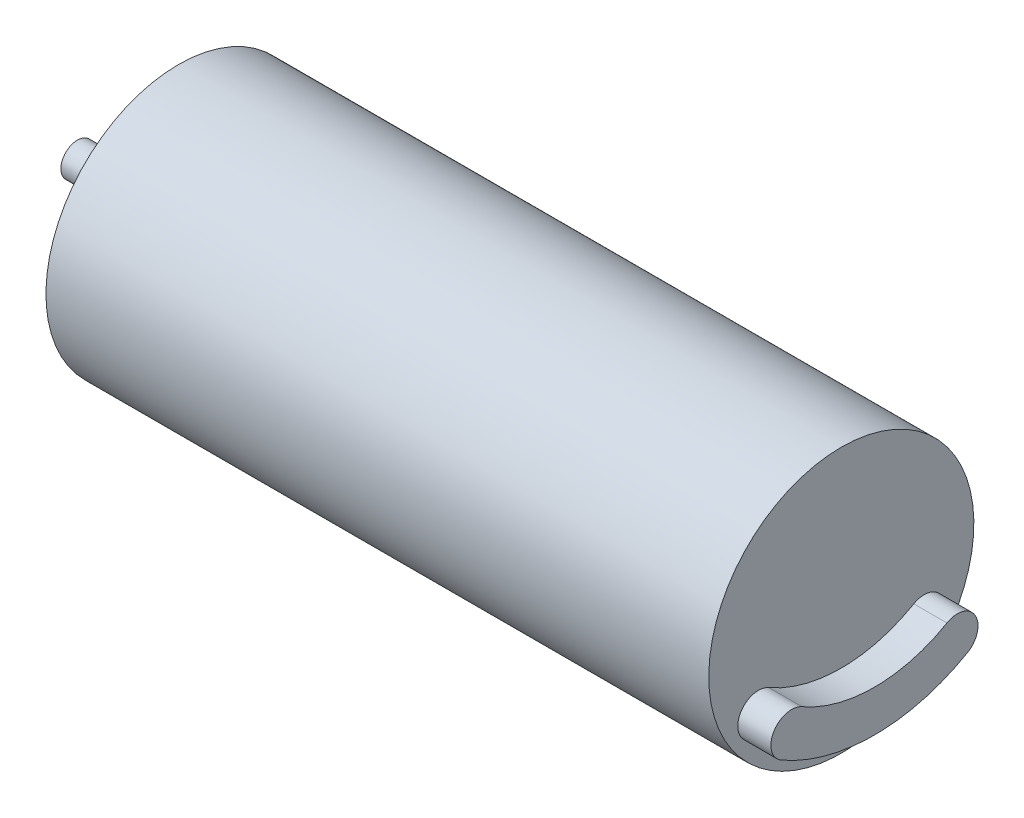
ISO-10303-21;
HEADER;
FILE_DESCRIPTION(('STEP AP214'),'2;1');
FILE_NAME('part.step','',(''),(''),'','','');
FILE_SCHEMA(('AUTOMOTIVE_DESIGN { 1 0 10303 214 1 1 1 1 }'));
ENDSEC;
DATA;
#1=APPLICATION_CONTEXT('core data for automotive mechanical design processes');
#2=APPLICATION_PROTOCOL_DEFINITION('international standard','automotive_design',2000,#1);
#3=PRODUCT_CONTEXT('',#1,'mechanical');
#4=PRODUCT('Part','Part','',(#3));
#5=PRODUCT_RELATED_PRODUCT_CATEGORY('part','',(#4));
#6=PRODUCT_DEFINITION_FORMATION('','',#4);
#7=PRODUCT_DEFINITION_CONTEXT('part definition',#1,'design');
#8=PRODUCT_DEFINITION('design','',#6,#7);
#9=PRODUCT_DEFINITION_SHAPE('','',#8);
#10=(LENGTH_UNIT() NAMED_UNIT(*) SI_UNIT(.MILLI.,.METRE.));
#11=(NAMED_UNIT(*) PLANE_ANGLE_UNIT() SI_UNIT($,.RADIAN.));
#12=(NAMED_UNIT(*) SI_UNIT($,.STERADIAN.) SOLID_ANGLE_UNIT());
#13=UNCERTAINTY_MEASURE_WITH_UNIT(LENGTH_MEASURE(1.E-05),#10,'distance_accuracy_value','');
#14=(GEOMETRIC_REPRESENTATION_CONTEXT(3) GLOBAL_UNCERTAINTY_ASSIGNED_CONTEXT((#13)) GLOBAL_UNIT_ASSIGNED_CONTEXT((#10,
#11,#12)) REPRESENTATION_CONTEXT('',''));
#15=CARTESIAN_POINT('',(0.,0.,0.));
#16=DIRECTION('',(0.,0.,1.));
#17=DIRECTION('',(1.,0.,0.));
#18=AXIS2_PLACEMENT_3D('',#15,#16,#17);
#19=CARTESIAN_POINT('',(-17.95,0.,0.));
#20=DIRECTION('',(1.,0.,0.));
#21=DIRECTION('',(0.,0.,-1.));
#22=AXIS2_PLACEMENT_3D('',#19,#20,#21);
#23=CYLINDRICAL_SURFACE('',#22,4.5);
#24=CARTESIAN_POINT('',(-17.95,0.,0.));
#25=DIRECTION('',(-1.,0.,0.));
#26=DIRECTION('',(0.,0.,1.));
#27=AXIS2_PLACEMENT_3D('',#24,#25,#26);
#28=CIRCLE('',#27,4.5);
#29=CARTESIAN_POINT('',(-17.95,0.,4.5));
#30=VERTEX_POINT('',#29);
#31=EDGE_CURVE('E11',#30,#30,#28,.T.);
#32=ORIENTED_EDGE('',*,*,#31,.F.);
#33=EDGE_LOOP('',(#32));
#34=FACE_BOUND('',#33,.T.);
#35=CARTESIAN_POINT('',(-16.95,0.,0.));
#36=DIRECTION('',(-1.,0.,0.));
#37=DIRECTION('',(0.,0.,1.));
#38=AXIS2_PLACEMENT_3D('',#35,#36,#37);
#39=CIRCLE('',#38,4.5);
#40=CARTESIAN_POINT('',(-16.95,0.,4.5));
#41=VERTEX_POINT('',#40);
#42=EDGE_CURVE('E45',#41,#41,#39,.T.);
#43=ORIENTED_EDGE('',*,*,#42,.T.);
#44=EDGE_LOOP('',(#43));
#45=FACE_BOUND('',#44,.T.);
#46=ADVANCED_FACE('F42',(#34,#45),#23,.T.);
#47=CARTESIAN_POINT('',(-17.95,0.,0.));
#48=DIRECTION('',(-1.,0.,0.));
#49=DIRECTION('',(0.,0.,1.));
#50=AXIS2_PLACEMENT_3D('',#47,#48,#49);
#51=PLANE('',#50);
#52=ORIENTED_EDGE('',*,*,#31,.T.);
#53=EDGE_LOOP('',(#52));
#54=FACE_BOUND('',#53,.T.);
#55=ADVANCED_FACE('F57',(#54),#51,.T.);
#56=CARTESIAN_POINT('',(-16.95,0.,0.));
#57=DIRECTION('',(-1.,0.,0.));
#58=DIRECTION('',(0.,0.,1.));
#59=AXIS2_PLACEMENT_3D('',#56,#57,#58);
#60=PLANE('',#59);
#61=ORIENTED_EDGE('',*,*,#42,.F.);
#62=EDGE_LOOP('',(#61));
#63=FACE_BOUND('',#62,.T.);
#64=ADVANCED_FACE('F55',(#63),#60,.F.);
#65=CLOSED_SHELL('',(#46,#55,#64));
#66=MANIFOLD_SOLID_BREP('B2',#65);
#67=CARTESIAN_POINT('',(25.05,5.20000000000037,-2.15973072759112E-13));
#68=DIRECTION('',(-1.,0.,0.));
#69=DIRECTION('',(0.,0.,1.));
#70=AXIS2_PLACEMENT_3D('',#67,#68,#69);
#71=CYLINDRICAL_SURFACE('',#70,8.75000000000014);
#72=CARTESIAN_POINT('',(23.05,5.20000000000037,-2.15973072759112E-13));
#73=DIRECTION('',(-1.,0.,0.));
#74=DIRECTION('',(0.,0.,-1.));
#75=AXIS2_PLACEMENT_3D('',#72,#73,#74);
#76=CIRCLE('',#75,8.75000000000014);
#77=CARTESIAN_POINT('',(23.05,-2.3777222831135,-4.37500000000043));
#78=VERTEX_POINT('',#77);
#79=CARTESIAN_POINT('',(23.05,-2.3777222831135,4.375));
#80=VERTEX_POINT('',#79);
#81=EDGE_CURVE('E154',#78,#80,#76,.T.);
#82=ORIENTED_EDGE('',*,*,#81,.T.);
#83=DIRECTION('',(-1.,0.,0.));
#84=VECTOR('',#83,1.);
#85=CARTESIAN_POINT('',(25.05,-2.3777222831135,4.375));
#86=LINE('',#85,#84);
#87=CARTESIAN_POINT('',(25.05,-2.3777222831135,4.375));
#88=VERTEX_POINT('',#87);
#89=EDGE_CURVE('E40',#88,#80,#86,.T.);
#90=ORIENTED_EDGE('',*,*,#89,.F.);
#91=CARTESIAN_POINT('',(25.05,5.20000000000037,-2.15973072759112E-13));
#92=DIRECTION('',(-1.,0.,0.));
#93=DIRECTION('',(0.,0.,-1.));
#94=AXIS2_PLACEMENT_3D('',#91,#92,#93);
#95=CIRCLE('',#94,8.75000000000014);
#96=CARTESIAN_POINT('',(25.05,-2.3777222831135,-4.37500000000043));
#97=VERTEX_POINT('',#96);
#98=EDGE_CURVE('E142',#97,#88,#95,.T.);
#99=ORIENTED_EDGE('',*,*,#98,.F.);
#100=DIRECTION('',(-1.,0.,0.));
#101=VECTOR('',#100,1.);
#102=CARTESIAN_POINT('',(25.05,-2.3777222831135,-4.37500000000043));
#103=LINE('',#102,#101);
#104=EDGE_CURVE('E150',#97,#78,#103,.T.);
#105=ORIENTED_EDGE('',*,*,#104,.T.);
#106=EDGE_LOOP('',(#82,#90,#99,#105));
#107=FACE_BOUND('',#106,.T.);
#108=ADVANCED_FACE('F91',(#107),#71,.F.);
#109=CARTESIAN_POINT('',(25.05,-3.460254037844,5.));
#110=DIRECTION('',(-1.,0.,0.));
#111=DIRECTION('',(0.,0.,1.));
#112=AXIS2_PLACEMENT_3D('',#109,#110,#111);
#113=CYLINDRICAL_SURFACE('',#112,1.24999999999996);
#114=CARTESIAN_POINT('',(23.05,-3.460254037844,5.));
#115=DIRECTION('',(1.,0.,0.));
#116=DIRECTION('',(0.,0.,1.));
#117=AXIS2_PLACEMENT_3D('',#114,#115,#116);
#118=CIRCLE('',#117,1.24999999999996);
#119=CARTESIAN_POINT('',(23.05,-4.54278579257451,5.62499999999999));
#120=VERTEX_POINT('',#119);
#121=EDGE_CURVE('E146',#80,#120,#118,.T.);
#122=ORIENTED_EDGE('',*,*,#121,.T.);
#123=DIRECTION('',(-1.,0.,0.));
#124=VECTOR('',#123,1.);
#125=CARTESIAN_POINT('',(25.05,-4.54278579257451,5.62499999999999));
#126=LINE('',#125,#124);
#127=CARTESIAN_POINT('',(25.05,-4.54278579257451,5.62499999999999));
#128=VERTEX_POINT('',#127);
#129=EDGE_CURVE('E99',#128,#120,#126,.T.);
#130=ORIENTED_EDGE('',*,*,#129,.F.);
#131=CARTESIAN_POINT('',(25.05,-3.460254037844,5.));
#132=DIRECTION('',(1.,0.,0.));
#133=DIRECTION('',(0.,0.,1.));
#134=AXIS2_PLACEMENT_3D('',#131,#132,#133);
#135=CIRCLE('',#134,1.24999999999996);
#136=EDGE_CURVE('E137',#88,#128,#135,.T.);
#137=ORIENTED_EDGE('',*,*,#136,.F.);
#138=ORIENTED_EDGE('',*,*,#89,.T.);
#139=EDGE_LOOP('',(#122,#130,#137,#138));
#140=FACE_BOUND('',#139,.T.);
#141=ADVANCED_FACE('F145',(#140),#113,.T.);
#142=CARTESIAN_POINT('',(25.05,5.20000000000037,-2.15973072759112E-13));
#143=DIRECTION('',(-1.,0.,0.));
#144=DIRECTION('',(0.,0.,1.));
#145=AXIS2_PLACEMENT_3D('',#142,#143,#144);
#146=CYLINDRICAL_SURFACE('',#145,11.2500000000001);
#147=CARTESIAN_POINT('',(23.05,5.20000000000037,-2.15973072759112E-13));
#148=DIRECTION('',(1.,0.,0.));
#149=DIRECTION('',(0.,0.,1.));
#150=AXIS2_PLACEMENT_3D('',#147,#148,#149);
#151=CIRCLE('',#150,11.2500000000001);
#152=CARTESIAN_POINT('',(23.05,-4.5427857925745,-5.62500000000043));
#153=VERTEX_POINT('',#152);
#154=EDGE_CURVE('E124',#120,#153,#151,.T.);
#155=ORIENTED_EDGE('',*,*,#154,.T.);
#156=DIRECTION('',(-1.,0.,0.));
#157=VECTOR('',#156,1.);
#158=CARTESIAN_POINT('',(25.05,-4.5427857925745,-5.62500000000043));
#159=LINE('',#158,#157);
#160=CARTESIAN_POINT('',(25.05,-4.5427857925745,-5.62500000000043));
#161=VERTEX_POINT('',#160);
#162=EDGE_CURVE('E147',#161,#153,#159,.T.);
#163=ORIENTED_EDGE('',*,*,#162,.F.);
#164=CARTESIAN_POINT('',(25.05,5.20000000000037,-2.15973072759112E-13));
#165=DIRECTION('',(1.,0.,0.));
#166=DIRECTION('',(0.,0.,1.));
#167=AXIS2_PLACEMENT_3D('',#164,#165,#166);
#168=CIRCLE('',#167,11.2500000000001);
#169=EDGE_CURVE('E140',#128,#161,#168,.T.);
#170=ORIENTED_EDGE('',*,*,#169,.F.);
#171=ORIENTED_EDGE('',*,*,#129,.T.);
#172=EDGE_LOOP('',(#155,#163,#170,#171));
#173=FACE_BOUND('',#172,.T.);
#174=ADVANCED_FACE('F148',(#173),#146,.T.);
#175=CARTESIAN_POINT('',(25.05,-3.460254037844,-5.00000000000043));
#176=DIRECTION('',(-1.,0.,0.));
#177=DIRECTION('',(0.,0.,1.));
#178=AXIS2_PLACEMENT_3D('',#175,#176,#177);
#179=CYLINDRICAL_SURFACE('',#178,1.24999999999996);
#180=CARTESIAN_POINT('',(23.05,-3.460254037844,-5.00000000000043));
#181=DIRECTION('',(1.,0.,0.));
#182=DIRECTION('',(0.,0.,1.));
#183=AXIS2_PLACEMENT_3D('',#180,#181,#182);
#184=CIRCLE('',#183,1.24999999999996);
#185=EDGE_CURVE('E130',#153,#78,#184,.T.);
#186=ORIENTED_EDGE('',*,*,#185,.T.);
#187=ORIENTED_EDGE('',*,*,#104,.F.);
#188=CARTESIAN_POINT('',(25.05,-3.460254037844,-5.00000000000043));
#189=DIRECTION('',(1.,0.,0.));
#190=DIRECTION('',(0.,0.,1.));
#191=AXIS2_PLACEMENT_3D('',#188,#189,#190);
#192=CIRCLE('',#191,1.24999999999996);
#193=EDGE_CURVE('E107',#161,#97,#192,.T.);
#194=ORIENTED_EDGE('',*,*,#193,.F.);
#195=ORIENTED_EDGE('',*,*,#162,.T.);
#196=EDGE_LOOP('',(#186,#187,#194,#195));
#197=FACE_BOUND('',#196,.T.);
#198=ADVANCED_FACE('F161',(#197),#179,.T.);
#199=CARTESIAN_POINT('',(25.05,0.869872981078183,-2.50000000000032));
#200=DIRECTION('',(1.,0.,0.));
#201=DIRECTION('',(0.,0.,-1.));
#202=AXIS2_PLACEMENT_3D('',#199,#200,#201);
#203=PLANE('',#202);
#204=ORIENTED_EDGE('',*,*,#98,.T.);
#205=ORIENTED_EDGE('',*,*,#136,.T.);
#206=ORIENTED_EDGE('',*,*,#169,.T.);
#207=ORIENTED_EDGE('',*,*,#193,.T.);
#208=EDGE_LOOP('',(#204,#205,#206,#207));
#209=FACE_BOUND('',#208,.T.);
#210=ADVANCED_FACE('F138',(#209),#203,.T.);
#211=CARTESIAN_POINT('',(23.05,0.869872981078183,-2.50000000000032));
#212=DIRECTION('',(1.,0.,0.));
#213=DIRECTION('',(0.,0.,-1.));
#214=AXIS2_PLACEMENT_3D('',#211,#212,#213);
#215=PLANE('',#214);
#216=ORIENTED_EDGE('',*,*,#81,.F.);
#217=ORIENTED_EDGE('',*,*,#185,.F.);
#218=ORIENTED_EDGE('',*,*,#154,.F.);
#219=ORIENTED_EDGE('',*,*,#121,.F.);
#220=EDGE_LOOP('',(#216,#217,#218,#219));
#221=FACE_BOUND('',#220,.T.);
#222=ADVANCED_FACE('F164',(#221),#215,.F.);
#223=CLOSED_SHELL('',(#108,#141,#174,#198,#210,#222));
#224=MANIFOLD_SOLID_BREP('B6',#223);
#225=CARTESIAN_POINT('',(-16.95,0.,0.));
#226=DIRECTION('',(1.,0.,0.));
#227=DIRECTION('',(0.,1.,0.));
#228=AXIS2_PLACEMENT_3D('',#225,#226,#227);
#229=CYLINDRICAL_SURFACE('',#228,8.00000000000001);
#230=CARTESIAN_POINT('',(-16.95,0.,0.));
#231=DIRECTION('',(1.,0.,0.));
#232=DIRECTION('',(0.,1.,0.));
#233=AXIS2_PLACEMENT_3D('',#230,#231,#232);
#234=CIRCLE('',#233,8.00000000000001);
#235=CARTESIAN_POINT('',(-16.95,8.,0.));
#236=VERTEX_POINT('',#235);
#237=EDGE_CURVE('E90',#236,#236,#234,.T.);
#238=ORIENTED_EDGE('',*,*,#237,.T.);
#239=EDGE_LOOP('',(#238));
#240=FACE_BOUND('',#239,.T.);
#241=CARTESIAN_POINT('',(23.05,0.,0.));
#242=DIRECTION('',(1.,0.,0.));
#243=DIRECTION('',(0.,1.,0.));
#244=AXIS2_PLACEMENT_3D('',#241,#242,#243);
#245=CIRCLE('',#244,8.00000000000001);
#246=CARTESIAN_POINT('',(23.05,8.,0.));
#247=VERTEX_POINT('',#246);
#248=EDGE_CURVE('E228',#247,#247,#245,.T.);
#249=ORIENTED_EDGE('',*,*,#248,.F.);
#250=EDGE_LOOP('',(#249));
#251=FACE_BOUND('',#250,.T.);
#252=ADVANCED_FACE('F222',(#240,#251),#229,.T.);
#253=CARTESIAN_POINT('',(-16.95,8.,0.));
#254=DIRECTION('',(-1.,0.,0.));
#255=DIRECTION('',(0.,-1.,0.));
#256=AXIS2_PLACEMENT_3D('',#253,#254,#255);
#257=PLANE('',#256);
#258=CARTESIAN_POINT('',(-16.95,-2.75000000000001,-4.76313972081441));
#259=DIRECTION('',(-1.,0.,0.));
#260=DIRECTION('',(0.,0.,1.));
#261=AXIS2_PLACEMENT_3D('',#258,#259,#260);
#262=CIRCLE('',#261,0.783500000000015);
#263=CARTESIAN_POINT('',(-16.95,-2.75000000000001,-3.9796397208144));
#264=VERTEX_POINT('',#263);
#265=EDGE_CURVE('E250',#264,#264,#262,.T.);
#266=ORIENTED_EDGE('',*,*,#265,.F.);
#267=EDGE_LOOP('',(#266));
#268=FACE_BOUND('',#267,.T.);
#269=CARTESIAN_POINT('',(-16.95,-2.75,4.76313972081441));
#270=DIRECTION('',(-1.,0.,0.));
#271=DIRECTION('',(0.,0.,1.));
#272=AXIS2_PLACEMENT_3D('',#269,#270,#271);
#273=CIRCLE('',#272,0.783500000000015);
#274=CARTESIAN_POINT('',(-16.95,-2.75,5.54663972081443));
#275=VERTEX_POINT('',#274);
#276=EDGE_CURVE('E244',#275,#275,#273,.T.);
#277=ORIENTED_EDGE('',*,*,#276,.F.);
#278=EDGE_LOOP('',(#277));
#279=FACE_BOUND('',#278,.T.);
#280=CARTESIAN_POINT('',(-16.95,5.5,0.));
#281=DIRECTION('',(-1.,0.,0.));
#282=DIRECTION('',(0.,0.,1.));
#283=AXIS2_PLACEMENT_3D('',#280,#281,#282);
#284=CIRCLE('',#283,0.783500000000015);
#285=CARTESIAN_POINT('',(-16.95,5.5,0.783500000000015));
#286=VERTEX_POINT('',#285);
#287=EDGE_CURVE('E236',#286,#286,#284,.T.);
#288=ORIENTED_EDGE('',*,*,#287,.F.);
#289=EDGE_LOOP('',(#288));
#290=FACE_BOUND('',#289,.T.);
#291=ORIENTED_EDGE('',*,*,#237,.F.);
#292=EDGE_LOOP('',(#291));
#293=FACE_BOUND('',#292,.T.);
#294=ADVANCED_FACE('F256',(#268,#279,#290,#293),#257,.T.);
#295=CARTESIAN_POINT('',(23.05,0.,0.));
#296=DIRECTION('',(1.,0.,0.));
#297=DIRECTION('',(0.,1.,0.));
#298=AXIS2_PLACEMENT_3D('',#295,#296,#297);
#299=PLANE('',#298);
#300=ORIENTED_EDGE('',*,*,#248,.T.);
#301=EDGE_LOOP('',(#300));
#302=FACE_BOUND('',#301,.T.);
#303=ADVANCED_FACE('F259',(#302),#299,.T.);
#304=CARTESIAN_POINT('',(-13.45,5.5,0.));
#305=DIRECTION('',(1.,0.,0.));
#306=DIRECTION('',(0.,0.,-1.));
#307=AXIS2_PLACEMENT_3D('',#304,#305,#306);
#308=PLANE('',#307);
#309=CARTESIAN_POINT('',(-13.45,5.5,0.));
#310=DIRECTION('',(-1.,0.,0.));
#311=DIRECTION('',(0.,0.,1.));
#312=AXIS2_PLACEMENT_3D('',#309,#310,#311);
#313=CIRCLE('',#312,0.783500000000015);
#314=CARTESIAN_POINT('',(-13.45,5.5,0.783500000000015));
#315=VERTEX_POINT('',#314);
#316=EDGE_CURVE('E232',#315,#315,#313,.T.);
#317=ORIENTED_EDGE('',*,*,#316,.T.);
#318=EDGE_LOOP('',(#317));
#319=FACE_BOUND('',#318,.T.);
#320=ADVANCED_FACE('F268',(#319),#308,.F.);
#321=CARTESIAN_POINT('',(-16.95,5.5,0.));
#322=DIRECTION('',(-1.,0.,0.));
#323=DIRECTION('',(0.,0.,1.));
#324=AXIS2_PLACEMENT_3D('',#321,#322,#323);
#325=CYLINDRICAL_SURFACE('',#324,0.783500000000015);
#326=ORIENTED_EDGE('',*,*,#316,.F.);
#327=EDGE_LOOP('',(#326));
#328=FACE_BOUND('',#327,.T.);
#329=ORIENTED_EDGE('',*,*,#287,.T.);
#330=EDGE_LOOP('',(#329));
#331=FACE_BOUND('',#330,.T.);
#332=ADVANCED_FACE('F265',(#328,#331),#325,.F.);
#333=CARTESIAN_POINT('',(-13.45,-2.75,4.76313972081441));
#334=DIRECTION('',(1.,0.,0.));
#335=DIRECTION('',(0.,0.,-1.));
#336=AXIS2_PLACEMENT_3D('',#333,#334,#335);
#337=PLANE('',#336);
#338=CARTESIAN_POINT('',(-13.45,-2.75,4.76313972081441));
#339=DIRECTION('',(-1.,0.,0.));
#340=DIRECTION('',(0.,0.,1.));
#341=AXIS2_PLACEMENT_3D('',#338,#339,#340);
#342=CIRCLE('',#341,0.783500000000015);
#343=CARTESIAN_POINT('',(-13.45,-2.75,5.54663972081443));
#344=VERTEX_POINT('',#343);
#345=EDGE_CURVE('E241',#344,#344,#342,.T.);
#346=ORIENTED_EDGE('',*,*,#345,.T.);
#347=EDGE_LOOP('',(#346));
#348=FACE_BOUND('',#347,.T.);
#349=ADVANCED_FACE('F267',(#348),#337,.F.);
#350=CARTESIAN_POINT('',(-16.95,-2.75,4.76313972081441));
#351=DIRECTION('',(-1.,0.,0.));
#352=DIRECTION('',(0.,0.,1.));
#353=AXIS2_PLACEMENT_3D('',#350,#351,#352);
#354=CYLINDRICAL_SURFACE('',#353,0.783500000000015);
#355=ORIENTED_EDGE('',*,*,#345,.F.);
#356=EDGE_LOOP('',(#355));
#357=FACE_BOUND('',#356,.T.);
#358=ORIENTED_EDGE('',*,*,#276,.T.);
#359=EDGE_LOOP('',(#358));
#360=FACE_BOUND('',#359,.T.);
#361=ADVANCED_FACE('F275',(#357,#360),#354,.F.);
#362=CARTESIAN_POINT('',(-13.45,-2.75000000000001,-4.76313972081441));
#363=DIRECTION('',(1.,0.,0.));
#364=DIRECTION('',(0.,0.,-1.));
#365=AXIS2_PLACEMENT_3D('',#362,#363,#364);
#366=PLANE('',#365);
#367=CARTESIAN_POINT('',(-13.45,-2.75000000000001,-4.76313972081441));
#368=DIRECTION('',(-1.,0.,0.));
#369=DIRECTION('',(0.,0.,1.));
#370=AXIS2_PLACEMENT_3D('',#367,#368,#369);
#371=CIRCLE('',#370,0.783500000000015);
#372=CARTESIAN_POINT('',(-13.45,-2.75000000000001,-3.9796397208144));
#373=VERTEX_POINT('',#372);
#374=EDGE_CURVE('E247',#373,#373,#371,.T.);
#375=ORIENTED_EDGE('',*,*,#374,.T.);
#376=EDGE_LOOP('',(#375));
#377=FACE_BOUND('',#376,.T.);
#378=ADVANCED_FACE('F318',(#377),#366,.F.);
#379=CARTESIAN_POINT('',(-16.95,-2.75000000000001,-4.76313972081441));
#380=DIRECTION('',(-1.,0.,0.));
#381=DIRECTION('',(0.,0.,1.));
#382=AXIS2_PLACEMENT_3D('',#379,#380,#381);
#383=CYLINDRICAL_SURFACE('',#382,0.783500000000015);
#384=ORIENTED_EDGE('',*,*,#374,.F.);
#385=EDGE_LOOP('',(#384));
#386=FACE_BOUND('',#385,.T.);
#387=ORIENTED_EDGE('',*,*,#265,.T.);
#388=EDGE_LOOP('',(#387));
#389=FACE_BOUND('',#388,.T.);
#390=ADVANCED_FACE('F254',(#386,#389),#383,.F.);
#391=CLOSED_SHELL('',(#252,#294,#303,#320,#332,#349,#361,#378,#390));
#392=MANIFOLD_SOLID_BREP('B34',#391);
#393=CARTESIAN_POINT('',(-23.05,0.,0.));
#394=DIRECTION('',(1.,0.,0.));
#395=DIRECTION('',(0.,1.,0.));
#396=AXIS2_PLACEMENT_3D('',#393,#394,#395);
#397=CYLINDRICAL_SURFACE('',#396,1.);
#398=CARTESIAN_POINT('',(-18.45,0.,0.));
#399=DIRECTION('',(-1.,0.,0.));
#400=DIRECTION('',(0.,0.,1.));
#401=AXIS2_PLACEMENT_3D('',#398,#399,#400);
#402=CIRCLE('',#401,1.);
#403=CARTESIAN_POINT('',(-18.45,0.,1.));
#404=VERTEX_POINT('',#403);
#405=EDGE_CURVE('E356',#404,#404,#402,.F.);
#406=ORIENTED_EDGE('',*,*,#405,.F.);
#407=EDGE_LOOP('',(#406));
#408=FACE_BOUND('',#407,.T.);
#409=CARTESIAN_POINT('',(-23.05,0.,0.));
#410=DIRECTION('',(1.,0.,0.));
#411=DIRECTION('',(0.,1.,0.));
#412=AXIS2_PLACEMENT_3D('',#409,#410,#411);
#413=CIRCLE('',#412,1.);
#414=CARTESIAN_POINT('',(-23.05,0.999999999999997,0.));
#415=VERTEX_POINT('',#414);
#416=EDGE_CURVE('E221',#415,#415,#413,.T.);
#417=ORIENTED_EDGE('',*,*,#416,.T.);
#418=EDGE_LOOP('',(#417));
#419=FACE_BOUND('',#418,.T.);
#420=ADVANCED_FACE('F353',(#408,#419),#397,.T.);
#421=CARTESIAN_POINT('',(-23.05,0.999999999999997,0.));
#422=DIRECTION('',(-1.,0.,0.));
#423=DIRECTION('',(0.,-1.,0.));
#424=AXIS2_PLACEMENT_3D('',#421,#422,#423);
#425=PLANE('',#424);
#426=ORIENTED_EDGE('',*,*,#416,.F.);
#427=EDGE_LOOP('',(#426));
#428=FACE_BOUND('',#427,.T.);
#429=ADVANCED_FACE('F368',(#428),#425,.T.);
#430=CARTESIAN_POINT('',(-18.45,0.,0.));
#431=DIRECTION('',(-1.,0.,0.));
#432=DIRECTION('',(0.,0.,1.));
#433=AXIS2_PLACEMENT_3D('',#430,#431,#432);
#434=PLANE('',#433);
#435=ORIENTED_EDGE('',*,*,#405,.T.);
#436=EDGE_LOOP('',(#435));
#437=FACE_BOUND('',#436,.T.);
#438=ADVANCED_FACE('F365',(#437),#434,.F.);
#439=CLOSED_SHELL('',(#420,#429,#438));
#440=MANIFOLD_SOLID_BREP('B85',#439);
#441=ADVANCED_BREP_SHAPE_REPRESENTATION('',(#18,#66,#224,#392,#440),#14);
#442=SHAPE_DEFINITION_REPRESENTATION(#9,#441);
ENDSEC;
END-ISO-10303-21;
